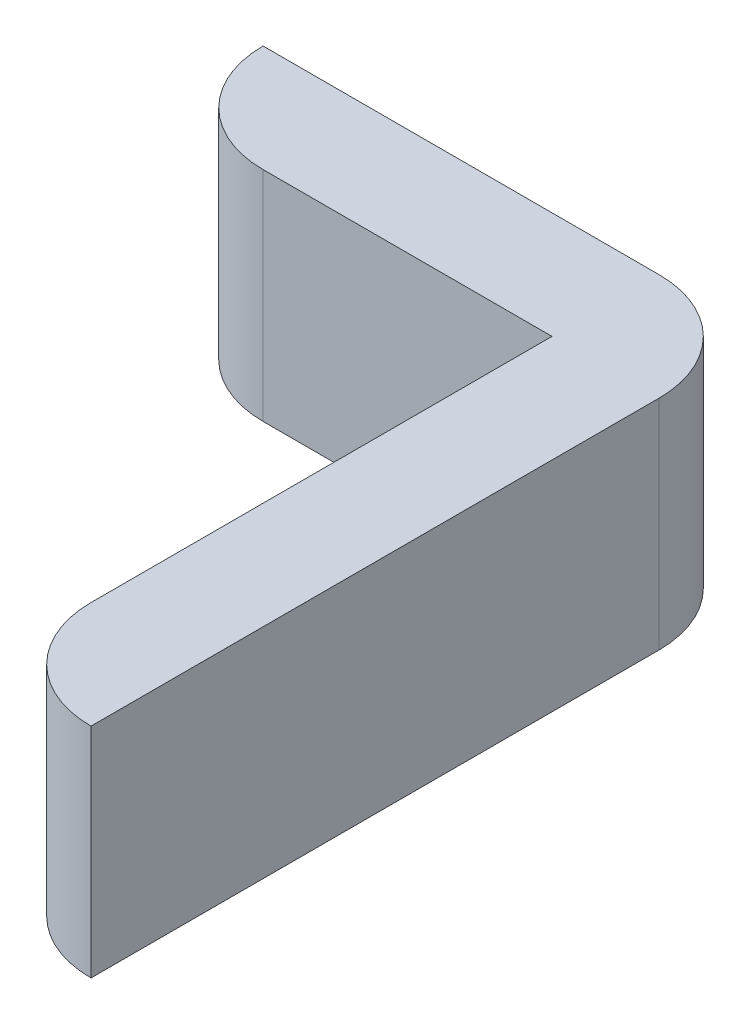
ISO-10303-21;
HEADER;
FILE_DESCRIPTION(('STEP AP214'),'2;1');
FILE_NAME('part.step','',(''),(''),'','','');
FILE_SCHEMA(('AUTOMOTIVE_DESIGN { 1 0 10303 214 1 1 1 1 }'));
ENDSEC;
DATA;
#1=APPLICATION_CONTEXT('core data for automotive mechanical design processes');
#2=APPLICATION_PROTOCOL_DEFINITION('international standard','automotive_design',2000,#1);
#3=PRODUCT_CONTEXT('',#1,'mechanical');
#4=PRODUCT('Part','Part','',(#3));
#5=PRODUCT_RELATED_PRODUCT_CATEGORY('part','',(#4));
#6=PRODUCT_DEFINITION_FORMATION('','',#4);
#7=PRODUCT_DEFINITION_CONTEXT('part definition',#1,'design');
#8=PRODUCT_DEFINITION('design','',#6,#7);
#9=PRODUCT_DEFINITION_SHAPE('','',#8);
#10=(LENGTH_UNIT() NAMED_UNIT(*) SI_UNIT(.MILLI.,.METRE.));
#11=(NAMED_UNIT(*) PLANE_ANGLE_UNIT() SI_UNIT($,.RADIAN.));
#12=(NAMED_UNIT(*) SI_UNIT($,.STERADIAN.) SOLID_ANGLE_UNIT());
#13=UNCERTAINTY_MEASURE_WITH_UNIT(LENGTH_MEASURE(1.E-05),#10,'distance_accuracy_value','');
#14=(GEOMETRIC_REPRESENTATION_CONTEXT(3) GLOBAL_UNCERTAINTY_ASSIGNED_CONTEXT((#13)) GLOBAL_UNIT_ASSIGNED_CONTEXT((#10,
#11,#12)) REPRESENTATION_CONTEXT('',''));
#15=CARTESIAN_POINT('',(0.,0.,0.));
#16=DIRECTION('',(0.,0.,1.));
#17=DIRECTION('',(1.,0.,0.));
#18=AXIS2_PLACEMENT_3D('',#15,#16,#17);
#19=CARTESIAN_POINT('',(9.275,-1.0152,0.));
#20=DIRECTION('',(0.,-1.,0.));
#21=DIRECTION('',(0.,0.,-1.));
#22=AXIS2_PLACEMENT_3D('',#19,#20,#21);
#23=PLANE('',#22);
#24=DIRECTION('',(-1.,0.,0.));
#25=VECTOR('',#24,1.);
#26=CARTESIAN_POINT('',(9.525,-1.0152,0.25));
#27=LINE('',#26,#25);
#28=CARTESIAN_POINT('',(9.525,-1.0152,0.25));
#29=VERTEX_POINT('',#28);
#30=CARTESIAN_POINT('',(10.2,-1.0152,0.25));
#31=VERTEX_POINT('',#30);
#32=EDGE_CURVE('E102',#29,#31,#27,.F.);
#33=ORIENTED_EDGE('',*,*,#32,.T.);
#34=DIRECTION('',(0.,0.,-1.));
#35=VECTOR('',#34,1.);
#36=CARTESIAN_POINT('',(10.2,-1.0152,0.25));
#37=LINE('',#36,#35);
#38=CARTESIAN_POINT('',(10.2,-1.0152,1.327));
#39=VERTEX_POINT('',#38);
#40=EDGE_CURVE('E108',#31,#39,#37,.F.);
#41=ORIENTED_EDGE('',*,*,#40,.T.);
#42=CARTESIAN_POINT('',(10.45,-1.0152,1.327));
#43=DIRECTION('',(0.,-1.,0.));
#44=DIRECTION('',(0.,0.,-1.));
#45=AXIS2_PLACEMENT_3D('',#42,#43,#44);
#46=CIRCLE('',#45,0.25);
#47=CARTESIAN_POINT('',(10.45,-1.0152,1.577));
#48=VERTEX_POINT('',#47);
#49=EDGE_CURVE('E80',#48,#39,#46,.T.);
#50=ORIENTED_EDGE('',*,*,#49,.F.);
#51=DIRECTION('',(0.,0.,1.));
#52=VECTOR('',#51,1.);
#53=CARTESIAN_POINT('',(10.45,-1.0152,1.577));
#54=LINE('',#53,#52);
#55=CARTESIAN_POINT('',(10.45,-1.0152,0.25));
#56=VERTEX_POINT('',#55);
#57=EDGE_CURVE('E75',#48,#56,#54,.F.);
#58=ORIENTED_EDGE('',*,*,#57,.T.);
#59=CARTESIAN_POINT('',(10.2,-1.0152,0.25));
#60=DIRECTION('',(0.,-1.,0.));
#61=DIRECTION('',(0.,0.,-1.));
#62=AXIS2_PLACEMENT_3D('',#59,#60,#61);
#63=CIRCLE('',#62,0.25);
#64=CARTESIAN_POINT('',(10.2,-1.0152,0.));
#65=VERTEX_POINT('',#64);
#66=EDGE_CURVE('E19',#65,#56,#63,.T.);
#67=ORIENTED_EDGE('',*,*,#66,.F.);
#68=DIRECTION('',(1.,0.,0.));
#69=VECTOR('',#68,1.);
#70=CARTESIAN_POINT('',(10.2,-1.0152,0.));
#71=LINE('',#70,#69);
#72=CARTESIAN_POINT('',(9.275,-1.0152,0.));
#73=VERTEX_POINT('',#72);
#74=EDGE_CURVE('E70',#65,#73,#71,.F.);
#75=ORIENTED_EDGE('',*,*,#74,.T.);
#76=CARTESIAN_POINT('',(9.525,-1.0152,0.));
#77=DIRECTION('',(0.,-1.,0.));
#78=DIRECTION('',(0.,0.,-1.));
#79=AXIS2_PLACEMENT_3D('',#76,#77,#78);
#80=CIRCLE('',#79,0.25);
#81=EDGE_CURVE('E121',#29,#73,#80,.T.);
#82=ORIENTED_EDGE('',*,*,#81,.F.);
#83=EDGE_LOOP('',(#33,#41,#50,#58,#67,#75,#82));
#84=FACE_BOUND('',#83,.T.);
#85=ADVANCED_FACE('F16',(#84),#23,.F.);
#86=CARTESIAN_POINT('',(10.2,-1.5248,0.));
#87=DIRECTION('',(0.,0.,1.));
#88=DIRECTION('',(1.,0.,0.));
#89=AXIS2_PLACEMENT_3D('',#86,#87,#88);
#90=PLANE('',#89);
#91=DIRECTION('',(0.,-1.,0.));
#92=VECTOR('',#91,1.);
#93=CARTESIAN_POINT('',(9.275,-1.5248,0.));
#94=LINE('',#93,#92);
#95=CARTESIAN_POINT('',(9.275,-1.5248,0.));
#96=VERTEX_POINT('',#95);
#97=EDGE_CURVE('E123',#73,#96,#94,.T.);
#98=ORIENTED_EDGE('',*,*,#97,.F.);
#99=ORIENTED_EDGE('',*,*,#74,.F.);
#100=DIRECTION('',(0.,-1.,0.));
#101=VECTOR('',#100,1.);
#102=CARTESIAN_POINT('',(10.2,-1.5248,0.));
#103=LINE('',#102,#101);
#104=CARTESIAN_POINT('',(10.2,-1.5248,0.));
#105=VERTEX_POINT('',#104);
#106=EDGE_CURVE('E92',#105,#65,#103,.F.);
#107=ORIENTED_EDGE('',*,*,#106,.F.);
#108=DIRECTION('',(1.,0.,0.));
#109=VECTOR('',#108,1.);
#110=CARTESIAN_POINT('',(9.275,-1.5248,0.));
#111=LINE('',#110,#109);
#112=EDGE_CURVE('E120',#96,#105,#111,.T.);
#113=ORIENTED_EDGE('',*,*,#112,.F.);
#114=EDGE_LOOP('',(#98,#99,#107,#113));
#115=FACE_BOUND('',#114,.T.);
#116=ADVANCED_FACE('F158',(#115),#90,.F.);
#117=CARTESIAN_POINT('',(10.2,-1.5248,0.25));
#118=DIRECTION('',(0.,-1.,0.));
#119=DIRECTION('',(0.,0.,-1.));
#120=AXIS2_PLACEMENT_3D('',#117,#118,#119);
#121=CYLINDRICAL_SURFACE('',#120,0.25);
#122=ORIENTED_EDGE('',*,*,#66,.T.);
#123=DIRECTION('',(0.,1.,0.));
#124=VECTOR('',#123,1.);
#125=CARTESIAN_POINT('',(10.45,-1.5248,0.25));
#126=LINE('',#125,#124);
#127=CARTESIAN_POINT('',(10.45,-1.5248,0.25));
#128=VERTEX_POINT('',#127);
#129=EDGE_CURVE('E86',#56,#128,#126,.F.);
#130=ORIENTED_EDGE('',*,*,#129,.T.);
#131=CARTESIAN_POINT('',(10.2,-1.5248,0.25));
#132=DIRECTION('',(0.,-1.,0.));
#133=DIRECTION('',(0.,0.,-1.));
#134=AXIS2_PLACEMENT_3D('',#131,#132,#133);
#135=CIRCLE('',#134,0.25);
#136=EDGE_CURVE('E118',#105,#128,#135,.T.);
#137=ORIENTED_EDGE('',*,*,#136,.F.);
#138=ORIENTED_EDGE('',*,*,#106,.T.);
#139=EDGE_LOOP('',(#122,#130,#137,#138));
#140=FACE_BOUND('',#139,.T.);
#141=ADVANCED_FACE('F89',(#140),#121,.T.);
#142=CARTESIAN_POINT('',(10.45,-1.5248,1.577));
#143=DIRECTION('',(-1.,0.,0.));
#144=DIRECTION('',(0.,0.,1.));
#145=AXIS2_PLACEMENT_3D('',#142,#143,#144);
#146=PLANE('',#145);
#147=DIRECTION('',(0.,-1.,0.));
#148=VECTOR('',#147,1.);
#149=CARTESIAN_POINT('',(10.45,-1.5248,1.577));
#150=LINE('',#149,#148);
#151=CARTESIAN_POINT('',(10.45,-1.5248,1.577));
#152=VERTEX_POINT('',#151);
#153=EDGE_CURVE('E85',#152,#48,#150,.F.);
#154=ORIENTED_EDGE('',*,*,#153,.F.);
#155=DIRECTION('',(0.,0.,-1.));
#156=VECTOR('',#155,1.);
#157=CARTESIAN_POINT('',(10.45,-1.5248,0.));
#158=LINE('',#157,#156);
#159=EDGE_CURVE('E94',#128,#152,#158,.F.);
#160=ORIENTED_EDGE('',*,*,#159,.F.);
#161=ORIENTED_EDGE('',*,*,#129,.F.);
#162=ORIENTED_EDGE('',*,*,#57,.F.);
#163=EDGE_LOOP('',(#154,#160,#161,#162));
#164=FACE_BOUND('',#163,.T.);
#165=ADVANCED_FACE('F93',(#164),#146,.F.);
#166=CARTESIAN_POINT('',(10.45,-1.5248,1.327));
#167=DIRECTION('',(0.,-1.,0.));
#168=DIRECTION('',(0.,0.,-1.));
#169=AXIS2_PLACEMENT_3D('',#166,#167,#168);
#170=CYLINDRICAL_SURFACE('',#169,0.25);
#171=ORIENTED_EDGE('',*,*,#49,.T.);
#172=DIRECTION('',(0.,1.,0.));
#173=VECTOR('',#172,1.);
#174=CARTESIAN_POINT('',(10.2,-1.5248,1.327));
#175=LINE('',#174,#173);
#176=CARTESIAN_POINT('',(10.2,-1.5248,1.327));
#177=VERTEX_POINT('',#176);
#178=EDGE_CURVE('E105',#39,#177,#175,.F.);
#179=ORIENTED_EDGE('',*,*,#178,.T.);
#180=CARTESIAN_POINT('',(10.45,-1.5248,1.327));
#181=DIRECTION('',(0.,-1.,0.));
#182=DIRECTION('',(0.,0.,-1.));
#183=AXIS2_PLACEMENT_3D('',#180,#181,#182);
#184=CIRCLE('',#183,0.25);
#185=EDGE_CURVE('E114',#152,#177,#184,.T.);
#186=ORIENTED_EDGE('',*,*,#185,.F.);
#187=ORIENTED_EDGE('',*,*,#153,.T.);
#188=EDGE_LOOP('',(#171,#179,#186,#187));
#189=FACE_BOUND('',#188,.T.);
#190=ADVANCED_FACE('F127',(#189),#170,.T.);
#191=CARTESIAN_POINT('',(10.2,-1.5248,0.25));
#192=DIRECTION('',(1.,0.,0.));
#193=DIRECTION('',(0.,0.,-1.));
#194=AXIS2_PLACEMENT_3D('',#191,#192,#193);
#195=PLANE('',#194);
#196=ORIENTED_EDGE('',*,*,#178,.F.);
#197=ORIENTED_EDGE('',*,*,#40,.F.);
#198=DIRECTION('',(0.,1.,0.));
#199=VECTOR('',#198,1.);
#200=CARTESIAN_POINT('',(10.2,-1.5248,0.25));
#201=LINE('',#200,#199);
#202=CARTESIAN_POINT('',(10.2,-1.5248,0.25));
#203=VERTEX_POINT('',#202);
#204=EDGE_CURVE('E104',#31,#203,#201,.F.);
#205=ORIENTED_EDGE('',*,*,#204,.T.);
#206=DIRECTION('',(0.,0.,-1.));
#207=VECTOR('',#206,1.);
#208=CARTESIAN_POINT('',(10.2,-1.5248,0.));
#209=LINE('',#208,#207);
#210=EDGE_CURVE('E117',#177,#203,#209,.T.);
#211=ORIENTED_EDGE('',*,*,#210,.F.);
#212=EDGE_LOOP('',(#196,#197,#205,#211));
#213=FACE_BOUND('',#212,.T.);
#214=ADVANCED_FACE('F150',(#213),#195,.F.);
#215=CARTESIAN_POINT('',(9.525,-1.5248,0.25));
#216=DIRECTION('',(0.,0.,-1.));
#217=DIRECTION('',(-1.,0.,0.));
#218=AXIS2_PLACEMENT_3D('',#215,#216,#217);
#219=PLANE('',#218);
#220=ORIENTED_EDGE('',*,*,#204,.F.);
#221=ORIENTED_EDGE('',*,*,#32,.F.);
#222=DIRECTION('',(0.,-1.,0.));
#223=VECTOR('',#222,1.);
#224=CARTESIAN_POINT('',(9.525,-1.5248,0.25));
#225=LINE('',#224,#223);
#226=CARTESIAN_POINT('',(9.525,-1.5248,0.25));
#227=VERTEX_POINT('',#226);
#228=EDGE_CURVE('E34',#227,#29,#225,.F.);
#229=ORIENTED_EDGE('',*,*,#228,.F.);
#230=DIRECTION('',(1.,0.,0.));
#231=VECTOR('',#230,1.);
#232=CARTESIAN_POINT('',(9.275,-1.5248,0.25));
#233=LINE('',#232,#231);
#234=EDGE_CURVE('E25',#203,#227,#233,.F.);
#235=ORIENTED_EDGE('',*,*,#234,.F.);
#236=EDGE_LOOP('',(#220,#221,#229,#235));
#237=FACE_BOUND('',#236,.T.);
#238=ADVANCED_FACE('F151',(#237),#219,.F.);
#239=CARTESIAN_POINT('',(9.525,-1.5248,0.));
#240=DIRECTION('',(0.,-1.,0.));
#241=DIRECTION('',(0.,0.,-1.));
#242=AXIS2_PLACEMENT_3D('',#239,#240,#241);
#243=CYLINDRICAL_SURFACE('',#242,0.25);
#244=ORIENTED_EDGE('',*,*,#81,.T.);
#245=ORIENTED_EDGE('',*,*,#97,.T.);
#246=CARTESIAN_POINT('',(9.525,-1.5248,0.));
#247=DIRECTION('',(0.,-1.,0.));
#248=DIRECTION('',(0.,0.,-1.));
#249=AXIS2_PLACEMENT_3D('',#246,#247,#248);
#250=CIRCLE('',#249,0.25);
#251=EDGE_CURVE('E11',#227,#96,#250,.T.);
#252=ORIENTED_EDGE('',*,*,#251,.F.);
#253=ORIENTED_EDGE('',*,*,#228,.T.);
#254=EDGE_LOOP('',(#244,#245,#252,#253));
#255=FACE_BOUND('',#254,.T.);
#256=ADVANCED_FACE('F156',(#255),#243,.T.);
#257=CARTESIAN_POINT('',(9.275,-1.5248,0.));
#258=DIRECTION('',(0.,-1.,0.));
#259=DIRECTION('',(0.,0.,-1.));
#260=AXIS2_PLACEMENT_3D('',#257,#258,#259);
#261=PLANE('',#260);
#262=ORIENTED_EDGE('',*,*,#234,.T.);
#263=ORIENTED_EDGE('',*,*,#251,.T.);
#264=ORIENTED_EDGE('',*,*,#112,.T.);
#265=ORIENTED_EDGE('',*,*,#136,.T.);
#266=ORIENTED_EDGE('',*,*,#159,.T.);
#267=ORIENTED_EDGE('',*,*,#185,.T.);
#268=ORIENTED_EDGE('',*,*,#210,.T.);
#269=EDGE_LOOP('',(#262,#263,#264,#265,#266,#267,#268));
#270=FACE_BOUND('',#269,.T.);
#271=ADVANCED_FACE('F132',(#270),#261,.T.);
#272=CLOSED_SHELL('',(#85,#116,#141,#165,#190,#214,#238,#256,#271));
#273=MANIFOLD_SOLID_BREP('B1',#272);
#274=ADVANCED_BREP_SHAPE_REPRESENTATION('',(#18,#273),#14);
#275=SHAPE_DEFINITION_REPRESENTATION(#9,#274);
ENDSEC;
END-ISO-10303-21;
